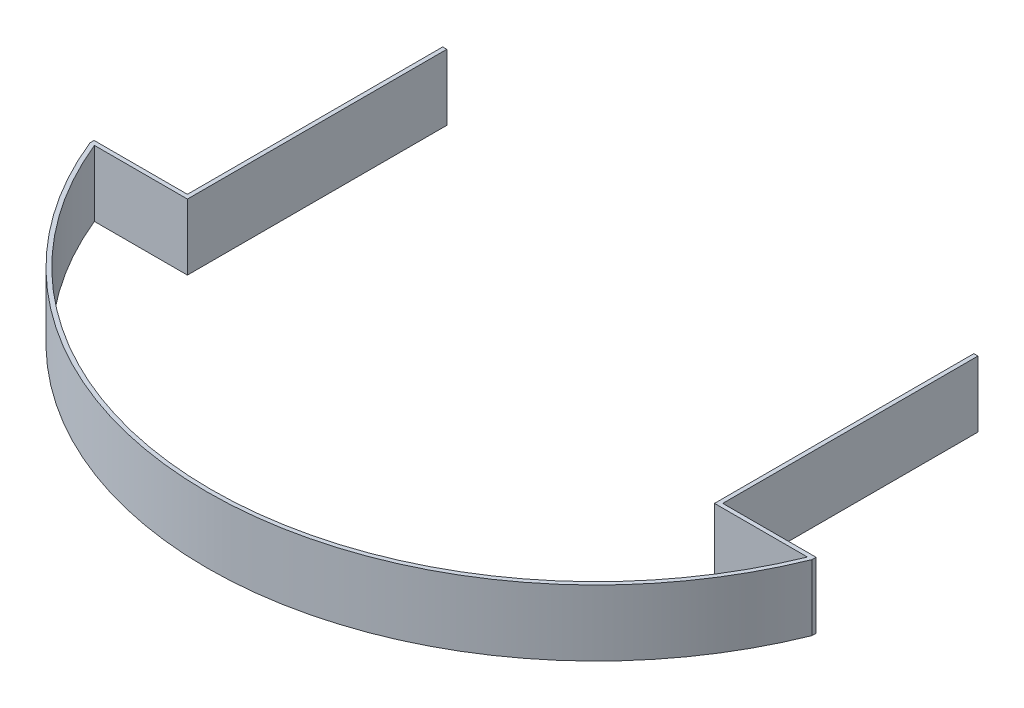
ISO-10303-21;
HEADER;
FILE_DESCRIPTION(('STEP AP214'),'2;1');
FILE_NAME('part.step','',(''),(''),'','','');
FILE_SCHEMA(('AUTOMOTIVE_DESIGN { 1 0 10303 214 1 1 1 1 }'));
ENDSEC;
DATA;
#1=APPLICATION_CONTEXT('core data for automotive mechanical design processes');
#2=APPLICATION_PROTOCOL_DEFINITION('international standard','automotive_design',2000,#1);
#3=PRODUCT_CONTEXT('',#1,'mechanical');
#4=PRODUCT('Part','Part','',(#3));
#5=PRODUCT_RELATED_PRODUCT_CATEGORY('part','',(#4));
#6=PRODUCT_DEFINITION_FORMATION('','',#4);
#7=PRODUCT_DEFINITION_CONTEXT('part definition',#1,'design');
#8=PRODUCT_DEFINITION('design','',#6,#7);
#9=PRODUCT_DEFINITION_SHAPE('','',#8);
#10=(LENGTH_UNIT() NAMED_UNIT(*) SI_UNIT(.MILLI.,.METRE.));
#11=(NAMED_UNIT(*) PLANE_ANGLE_UNIT() SI_UNIT($,.RADIAN.));
#12=(NAMED_UNIT(*) SI_UNIT($,.STERADIAN.) SOLID_ANGLE_UNIT());
#13=UNCERTAINTY_MEASURE_WITH_UNIT(LENGTH_MEASURE(1.E-05),#10,'distance_accuracy_value','');
#14=(GEOMETRIC_REPRESENTATION_CONTEXT(3) GLOBAL_UNCERTAINTY_ASSIGNED_CONTEXT((#13)) GLOBAL_UNIT_ASSIGNED_CONTEXT((#10,
#11,#12)) REPRESENTATION_CONTEXT('',''));
#15=CARTESIAN_POINT('',(0.,0.,0.));
#16=DIRECTION('',(0.,0.,1.));
#17=DIRECTION('',(1.,0.,0.));
#18=AXIS2_PLACEMENT_3D('',#15,#16,#17);
#19=CARTESIAN_POINT('',(-330.141421356237,25.4,56.));
#20=DIRECTION('',(0.,0.,-1.));
#21=DIRECTION('',(-1.,0.,0.));
#22=AXIS2_PLACEMENT_3D('',#19,#20,#21);
#23=PLANE('',#22);
#24=DIRECTION('',(1.,0.,0.));
#25=VECTOR('',#24,1.);
#26=CARTESIAN_POINT('',(-330.141421356237,0.,56.));
#27=LINE('',#26,#25);
#28=CARTESIAN_POINT('',(101.6,0.,56.));
#29=VERTEX_POINT('',#28);
#30=CARTESIAN_POINT('',(137.441339283347,0.,56.));
#31=VERTEX_POINT('',#30);
#32=EDGE_CURVE('E161',#29,#31,#27,.T.);
#33=ORIENTED_EDGE('',*,*,#32,.T.);
#34=DIRECTION('',(0.,-1.,0.));
#35=VECTOR('',#34,1.);
#36=CARTESIAN_POINT('',(137.441339283347,25.4,56.));
#37=LINE('',#36,#35);
#38=CARTESIAN_POINT('',(137.441339283347,25.4,56.));
#39=VERTEX_POINT('',#38);
#40=EDGE_CURVE('E11',#39,#31,#37,.T.);
#41=ORIENTED_EDGE('',*,*,#40,.F.);
#42=DIRECTION('',(1.,0.,0.));
#43=VECTOR('',#42,1.);
#44=CARTESIAN_POINT('',(-330.141421356237,25.4,56.));
#45=LINE('',#44,#43);
#46=CARTESIAN_POINT('',(101.6,25.4,56.));
#47=VERTEX_POINT('',#46);
#48=EDGE_CURVE('E101',#47,#39,#45,.T.);
#49=ORIENTED_EDGE('',*,*,#48,.F.);
#50=DIRECTION('',(0.,-1.,0.));
#51=VECTOR('',#50,1.);
#52=CARTESIAN_POINT('',(101.6,25.4,56.));
#53=LINE('',#52,#51);
#54=EDGE_CURVE('E157',#47,#29,#53,.T.);
#55=ORIENTED_EDGE('',*,*,#54,.T.);
#56=EDGE_LOOP('',(#33,#41,#49,#55));
#57=FACE_BOUND('',#56,.T.);
#58=ADVANCED_FACE('F31',(#57),#23,.F.);
#59=CARTESIAN_POINT('',(0.,25.4,0.));
#60=DIRECTION('',(0.,-1.,0.));
#61=DIRECTION('',(0.,0.,-1.));
#62=AXIS2_PLACEMENT_3D('',#59,#60,#61);
#63=CYLINDRICAL_SURFACE('',#62,148.412);
#64=CARTESIAN_POINT('',(0.,0.,0.));
#65=DIRECTION('',(0.,1.,0.));
#66=DIRECTION('',(0.,0.,1.));
#67=AXIS2_PLACEMENT_3D('',#64,#65,#66);
#68=CIRCLE('',#67,148.412);
#69=CARTESIAN_POINT('',(-137.441339283347,0.,56.));
#70=VERTEX_POINT('',#69);
#71=EDGE_CURVE('E164',#70,#31,#68,.T.);
#72=ORIENTED_EDGE('',*,*,#71,.F.);
#73=DIRECTION('',(0.,-1.,0.));
#74=VECTOR('',#73,1.);
#75=CARTESIAN_POINT('',(-137.441339283347,25.4,56.));
#76=LINE('',#75,#74);
#77=CARTESIAN_POINT('',(-137.441339283347,25.4,56.));
#78=VERTEX_POINT('',#77);
#79=EDGE_CURVE('E39',#78,#70,#76,.T.);
#80=ORIENTED_EDGE('',*,*,#79,.F.);
#81=CARTESIAN_POINT('',(0.,25.4,0.));
#82=DIRECTION('',(0.,1.,0.));
#83=DIRECTION('',(0.,0.,1.));
#84=AXIS2_PLACEMENT_3D('',#81,#82,#83);
#85=CIRCLE('',#84,148.412);
#86=EDGE_CURVE('E236',#78,#39,#85,.T.);
#87=ORIENTED_EDGE('',*,*,#86,.T.);
#88=ORIENTED_EDGE('',*,*,#40,.T.);
#89=EDGE_LOOP('',(#72,#80,#87,#88));
#90=FACE_BOUND('',#89,.T.);
#91=ADVANCED_FACE('F224',(#90),#63,.F.);
#92=CARTESIAN_POINT('',(-330.141421356237,25.4,56.));
#93=DIRECTION('',(0.,0.,1.));
#94=DIRECTION('',(1.,0.,0.));
#95=AXIS2_PLACEMENT_3D('',#92,#93,#94);
#96=PLANE('',#95);
#97=DIRECTION('',(-1.,0.,0.));
#98=VECTOR('',#97,1.);
#99=CARTESIAN_POINT('',(-330.141421356237,0.,56.));
#100=LINE('',#99,#98);
#101=CARTESIAN_POINT('',(-101.6,0.,56.));
#102=VERTEX_POINT('',#101);
#103=EDGE_CURVE('E167',#102,#70,#100,.T.);
#104=ORIENTED_EDGE('',*,*,#103,.F.);
#105=DIRECTION('',(0.,-1.,0.));
#106=VECTOR('',#105,1.);
#107=CARTESIAN_POINT('',(-101.6,25.4,56.));
#108=LINE('',#107,#106);
#109=CARTESIAN_POINT('',(-101.6,25.4,56.));
#110=VERTEX_POINT('',#109);
#111=EDGE_CURVE('E214',#110,#102,#108,.T.);
#112=ORIENTED_EDGE('',*,*,#111,.F.);
#113=DIRECTION('',(-1.,0.,0.));
#114=VECTOR('',#113,1.);
#115=CARTESIAN_POINT('',(-330.141421356237,25.4,56.));
#116=LINE('',#115,#114);
#117=EDGE_CURVE('E221',#110,#78,#116,.T.);
#118=ORIENTED_EDGE('',*,*,#117,.T.);
#119=ORIENTED_EDGE('',*,*,#79,.T.);
#120=EDGE_LOOP('',(#104,#112,#118,#119));
#121=FACE_BOUND('',#120,.T.);
#122=ADVANCED_FACE('F219',(#121),#96,.T.);
#123=CARTESIAN_POINT('',(-101.6,25.4,0.));
#124=DIRECTION('',(1.,0.,0.));
#125=DIRECTION('',(0.,0.,-1.));
#126=AXIS2_PLACEMENT_3D('',#123,#124,#125);
#127=PLANE('',#126);
#128=DIRECTION('',(0.,0.,1.));
#129=VECTOR('',#128,1.);
#130=CARTESIAN_POINT('',(-101.6,0.,0.));
#131=LINE('',#130,#129);
#132=CARTESIAN_POINT('',(-101.6,0.,-44.));
#133=VERTEX_POINT('',#132);
#134=EDGE_CURVE('E170',#133,#102,#131,.T.);
#135=ORIENTED_EDGE('',*,*,#134,.F.);
#136=DIRECTION('',(0.,-1.,0.));
#137=VECTOR('',#136,1.);
#138=CARTESIAN_POINT('',(-101.6,25.4,-44.));
#139=LINE('',#138,#137);
#140=CARTESIAN_POINT('',(-101.6,25.4,-44.));
#141=VERTEX_POINT('',#140);
#142=EDGE_CURVE('E212',#141,#133,#139,.T.);
#143=ORIENTED_EDGE('',*,*,#142,.F.);
#144=DIRECTION('',(0.,0.,1.));
#145=VECTOR('',#144,1.);
#146=CARTESIAN_POINT('',(-101.6,25.4,0.));
#147=LINE('',#146,#145);
#148=EDGE_CURVE('E235',#141,#110,#147,.T.);
#149=ORIENTED_EDGE('',*,*,#148,.T.);
#150=ORIENTED_EDGE('',*,*,#111,.T.);
#151=EDGE_LOOP('',(#135,#143,#149,#150));
#152=FACE_BOUND('',#151,.T.);
#153=ADVANCED_FACE('F231',(#152),#127,.T.);
#154=CARTESIAN_POINT('',(-330.141421356237,25.4,-44.));
#155=DIRECTION('',(0.,0.,1.));
#156=DIRECTION('',(1.,0.,0.));
#157=AXIS2_PLACEMENT_3D('',#154,#155,#156);
#158=PLANE('',#157);
#159=DIRECTION('',(-1.,0.,0.));
#160=VECTOR('',#159,1.);
#161=CARTESIAN_POINT('',(-330.141421356237,0.,-44.));
#162=LINE('',#161,#160);
#163=CARTESIAN_POINT('',(-103.188,0.,-44.));
#164=VERTEX_POINT('',#163);
#165=EDGE_CURVE('E173',#133,#164,#162,.T.);
#166=ORIENTED_EDGE('',*,*,#165,.T.);
#167=DIRECTION('',(0.,-1.,0.));
#168=VECTOR('',#167,1.);
#169=CARTESIAN_POINT('',(-103.188,25.4,-44.));
#170=LINE('',#169,#168);
#171=CARTESIAN_POINT('',(-103.188,25.4,-44.));
#172=VERTEX_POINT('',#171);
#173=EDGE_CURVE('E210',#172,#164,#170,.T.);
#174=ORIENTED_EDGE('',*,*,#173,.F.);
#175=DIRECTION('',(-1.,0.,0.));
#176=VECTOR('',#175,1.);
#177=CARTESIAN_POINT('',(-330.141421356237,25.4,-44.));
#178=LINE('',#177,#176);
#179=EDGE_CURVE('E238',#141,#172,#178,.T.);
#180=ORIENTED_EDGE('',*,*,#179,.F.);
#181=ORIENTED_EDGE('',*,*,#142,.T.);
#182=EDGE_LOOP('',(#166,#174,#180,#181));
#183=FACE_BOUND('',#182,.T.);
#184=ADVANCED_FACE('F289',(#183),#158,.F.);
#185=CARTESIAN_POINT('',(-103.188,25.4,0.));
#186=DIRECTION('',(-1.,0.,0.));
#187=DIRECTION('',(0.,0.,1.));
#188=AXIS2_PLACEMENT_3D('',#185,#186,#187);
#189=PLANE('',#188);
#190=DIRECTION('',(0.,0.,-1.));
#191=VECTOR('',#190,1.);
#192=CARTESIAN_POINT('',(-103.188,0.,0.));
#193=LINE('',#192,#191);
#194=CARTESIAN_POINT('',(-103.188,0.,54.4125));
#195=VERTEX_POINT('',#194);
#196=EDGE_CURVE('E176',#195,#164,#193,.T.);
#197=ORIENTED_EDGE('',*,*,#196,.F.);
#198=DIRECTION('',(0.,-1.,0.));
#199=VECTOR('',#198,1.);
#200=CARTESIAN_POINT('',(-103.188,25.4,54.4125));
#201=LINE('',#200,#199);
#202=CARTESIAN_POINT('',(-103.188,25.4,54.4125));
#203=VERTEX_POINT('',#202);
#204=EDGE_CURVE('E208',#203,#195,#201,.T.);
#205=ORIENTED_EDGE('',*,*,#204,.F.);
#206=DIRECTION('',(0.,0.,-1.));
#207=VECTOR('',#206,1.);
#208=CARTESIAN_POINT('',(-103.188,25.4,0.));
#209=LINE('',#208,#207);
#210=EDGE_CURVE('E244',#203,#172,#209,.T.);
#211=ORIENTED_EDGE('',*,*,#210,.T.);
#212=ORIENTED_EDGE('',*,*,#173,.T.);
#213=EDGE_LOOP('',(#197,#205,#211,#212));
#214=FACE_BOUND('',#213,.T.);
#215=ADVANCED_FACE('F292',(#214),#189,.T.);
#216=CARTESIAN_POINT('',(-330.141421356237,25.4,54.4125));
#217=DIRECTION('',(0.,0.,-1.));
#218=DIRECTION('',(-1.,0.,0.));
#219=AXIS2_PLACEMENT_3D('',#216,#217,#218);
#220=PLANE('',#219);
#221=DIRECTION('',(1.,0.,0.));
#222=VECTOR('',#221,1.);
#223=CARTESIAN_POINT('',(-330.141421356237,0.,54.4125));
#224=LINE('',#223,#222);
#225=CARTESIAN_POINT('',(-139.154590294392,0.,54.4125));
#226=VERTEX_POINT('',#225);
#227=EDGE_CURVE('E179',#226,#195,#224,.T.);
#228=ORIENTED_EDGE('',*,*,#227,.F.);
#229=DIRECTION('',(0.,-1.,0.));
#230=VECTOR('',#229,1.);
#231=CARTESIAN_POINT('',(-139.154590294392,25.4,54.4125));
#232=LINE('',#231,#230);
#233=CARTESIAN_POINT('',(-139.154590294392,25.4,54.4125));
#234=VERTEX_POINT('',#233);
#235=EDGE_CURVE('E206',#234,#226,#232,.T.);
#236=ORIENTED_EDGE('',*,*,#235,.F.);
#237=DIRECTION('',(1.,0.,0.));
#238=VECTOR('',#237,1.);
#239=CARTESIAN_POINT('',(-330.141421356237,25.4,54.4125));
#240=LINE('',#239,#238);
#241=EDGE_CURVE('E247',#234,#203,#240,.T.);
#242=ORIENTED_EDGE('',*,*,#241,.T.);
#243=ORIENTED_EDGE('',*,*,#204,.T.);
#244=EDGE_LOOP('',(#228,#236,#242,#243));
#245=FACE_BOUND('',#244,.T.);
#246=ADVANCED_FACE('F296',(#245),#220,.T.);
#247=CARTESIAN_POINT('',(-139.154590294392,25.4,0.));
#248=DIRECTION('',(-1.,0.,0.));
#249=DIRECTION('',(0.,0.,1.));
#250=AXIS2_PLACEMENT_3D('',#247,#248,#249);
#251=PLANE('',#250);
#252=DIRECTION('',(0.,0.,-1.));
#253=VECTOR('',#252,1.);
#254=CARTESIAN_POINT('',(-139.154590294392,0.,0.));
#255=LINE('',#254,#253);
#256=CARTESIAN_POINT('',(-139.154590294392,0.,56.));
#257=VERTEX_POINT('',#256);
#258=EDGE_CURVE('E182',#257,#226,#255,.T.);
#259=ORIENTED_EDGE('',*,*,#258,.F.);
#260=DIRECTION('',(0.,-1.,0.));
#261=VECTOR('',#260,1.);
#262=CARTESIAN_POINT('',(-139.154590294392,25.4,56.));
#263=LINE('',#262,#261);
#264=CARTESIAN_POINT('',(-139.154590294392,25.4,56.));
#265=VERTEX_POINT('',#264);
#266=EDGE_CURVE('E204',#265,#257,#263,.T.);
#267=ORIENTED_EDGE('',*,*,#266,.F.);
#268=DIRECTION('',(0.,0.,-1.));
#269=VECTOR('',#268,1.);
#270=CARTESIAN_POINT('',(-139.154590294392,25.4,0.));
#271=LINE('',#270,#269);
#272=EDGE_CURVE('E250',#265,#234,#271,.T.);
#273=ORIENTED_EDGE('',*,*,#272,.T.);
#274=ORIENTED_EDGE('',*,*,#235,.T.);
#275=EDGE_LOOP('',(#259,#267,#273,#274));
#276=FACE_BOUND('',#275,.T.);
#277=ADVANCED_FACE('F300',(#276),#251,.T.);
#278=CARTESIAN_POINT('',(0.,25.4,0.));
#279=DIRECTION('',(0.,-1.,0.));
#280=DIRECTION('',(0.,0.,-1.));
#281=AXIS2_PLACEMENT_3D('',#278,#279,#280);
#282=CYLINDRICAL_SURFACE('',#281,150.);
#283=CARTESIAN_POINT('',(0.,0.,0.));
#284=DIRECTION('',(0.,1.,0.));
#285=DIRECTION('',(0.,0.,1.));
#286=AXIS2_PLACEMENT_3D('',#283,#284,#285);
#287=CIRCLE('',#286,150.);
#288=CARTESIAN_POINT('',(139.154590294392,0.,56.));
#289=VERTEX_POINT('',#288);
#290=EDGE_CURVE('E185',#257,#289,#287,.T.);
#291=ORIENTED_EDGE('',*,*,#290,.T.);
#292=DIRECTION('',(0.,-1.,0.));
#293=VECTOR('',#292,1.);
#294=CARTESIAN_POINT('',(139.154590294392,25.4,56.));
#295=LINE('',#294,#293);
#296=CARTESIAN_POINT('',(139.154590294392,25.4,56.));
#297=VERTEX_POINT('',#296);
#298=EDGE_CURVE('E201',#297,#289,#295,.T.);
#299=ORIENTED_EDGE('',*,*,#298,.F.);
#300=CARTESIAN_POINT('',(0.,25.4,0.));
#301=DIRECTION('',(0.,1.,0.));
#302=DIRECTION('',(0.,0.,1.));
#303=AXIS2_PLACEMENT_3D('',#300,#301,#302);
#304=CIRCLE('',#303,150.);
#305=EDGE_CURVE('E253',#265,#297,#304,.T.);
#306=ORIENTED_EDGE('',*,*,#305,.F.);
#307=ORIENTED_EDGE('',*,*,#266,.T.);
#308=EDGE_LOOP('',(#291,#299,#306,#307));
#309=FACE_BOUND('',#308,.T.);
#310=ADVANCED_FACE('F304',(#309),#282,.T.);
#311=CARTESIAN_POINT('',(139.154590294392,25.4,0.));
#312=DIRECTION('',(-1.,0.,0.));
#313=DIRECTION('',(0.,0.,1.));
#314=AXIS2_PLACEMENT_3D('',#311,#312,#313);
#315=PLANE('',#314);
#316=DIRECTION('',(0.,0.,-1.));
#317=VECTOR('',#316,1.);
#318=CARTESIAN_POINT('',(139.154590294392,0.,0.));
#319=LINE('',#318,#317);
#320=CARTESIAN_POINT('',(139.154590294392,0.,54.412));
#321=VERTEX_POINT('',#320);
#322=EDGE_CURVE('E187',#289,#321,#319,.T.);
#323=ORIENTED_EDGE('',*,*,#322,.T.);
#324=DIRECTION('',(0.,-1.,0.));
#325=VECTOR('',#324,1.);
#326=CARTESIAN_POINT('',(139.154590294392,25.4,54.412));
#327=LINE('',#326,#325);
#328=CARTESIAN_POINT('',(139.154590294392,25.4,54.412));
#329=VERTEX_POINT('',#328);
#330=EDGE_CURVE('E198',#329,#321,#327,.T.);
#331=ORIENTED_EDGE('',*,*,#330,.F.);
#332=DIRECTION('',(0.,0.,-1.));
#333=VECTOR('',#332,1.);
#334=CARTESIAN_POINT('',(139.154590294392,25.4,0.));
#335=LINE('',#334,#333);
#336=EDGE_CURVE('E255',#297,#329,#335,.T.);
#337=ORIENTED_EDGE('',*,*,#336,.F.);
#338=ORIENTED_EDGE('',*,*,#298,.T.);
#339=EDGE_LOOP('',(#323,#331,#337,#338));
#340=FACE_BOUND('',#339,.T.);
#341=ADVANCED_FACE('F262',(#340),#315,.F.);
#342=CARTESIAN_POINT('',(-330.141421356237,25.4,54.4120000000001));
#343=DIRECTION('',(0.,0.,1.));
#344=DIRECTION('',(1.,0.,0.));
#345=AXIS2_PLACEMENT_3D('',#342,#343,#344);
#346=PLANE('',#345);
#347=DIRECTION('',(-1.,0.,0.));
#348=VECTOR('',#347,1.);
#349=CARTESIAN_POINT('',(-330.141421356237,0.,54.4120000000001));
#350=LINE('',#349,#348);
#351=CARTESIAN_POINT('',(103.188,0.,54.412));
#352=VERTEX_POINT('',#351);
#353=EDGE_CURVE('E189',#321,#352,#350,.T.);
#354=ORIENTED_EDGE('',*,*,#353,.T.);
#355=DIRECTION('',(0.,-1.,0.));
#356=VECTOR('',#355,1.);
#357=CARTESIAN_POINT('',(103.188,25.4,54.412));
#358=LINE('',#357,#356);
#359=CARTESIAN_POINT('',(103.188,25.4,54.412));
#360=VERTEX_POINT('',#359);
#361=EDGE_CURVE('E153',#360,#352,#358,.T.);
#362=ORIENTED_EDGE('',*,*,#361,.F.);
#363=DIRECTION('',(-1.,0.,0.));
#364=VECTOR('',#363,1.);
#365=CARTESIAN_POINT('',(-330.141421356237,25.4,54.4120000000001));
#366=LINE('',#365,#364);
#367=EDGE_CURVE('E140',#329,#360,#366,.T.);
#368=ORIENTED_EDGE('',*,*,#367,.F.);
#369=ORIENTED_EDGE('',*,*,#330,.T.);
#370=EDGE_LOOP('',(#354,#362,#368,#369));
#371=FACE_BOUND('',#370,.T.);
#372=ADVANCED_FACE('F266',(#371),#346,.F.);
#373=CARTESIAN_POINT('',(103.188,25.4,0.));
#374=DIRECTION('',(-1.,0.,0.));
#375=DIRECTION('',(0.,0.,1.));
#376=AXIS2_PLACEMENT_3D('',#373,#374,#375);
#377=PLANE('',#376);
#378=DIRECTION('',(0.,0.,-1.));
#379=VECTOR('',#378,1.);
#380=CARTESIAN_POINT('',(103.188,0.,0.));
#381=LINE('',#380,#379);
#382=CARTESIAN_POINT('',(103.188,0.,-44.));
#383=VERTEX_POINT('',#382);
#384=EDGE_CURVE('E149',#352,#383,#381,.T.);
#385=ORIENTED_EDGE('',*,*,#384,.T.);
#386=DIRECTION('',(0.,-1.,0.));
#387=VECTOR('',#386,1.);
#388=CARTESIAN_POINT('',(103.188,25.4,-44.));
#389=LINE('',#388,#387);
#390=CARTESIAN_POINT('',(103.188,25.4,-44.));
#391=VERTEX_POINT('',#390);
#392=EDGE_CURVE('E146',#391,#383,#389,.T.);
#393=ORIENTED_EDGE('',*,*,#392,.F.);
#394=DIRECTION('',(0.,0.,-1.));
#395=VECTOR('',#394,1.);
#396=CARTESIAN_POINT('',(103.188,25.4,0.));
#397=LINE('',#396,#395);
#398=EDGE_CURVE('E134',#360,#391,#397,.T.);
#399=ORIENTED_EDGE('',*,*,#398,.F.);
#400=ORIENTED_EDGE('',*,*,#361,.T.);
#401=EDGE_LOOP('',(#385,#393,#399,#400));
#402=FACE_BOUND('',#401,.T.);
#403=ADVANCED_FACE('F147',(#402),#377,.F.);
#404=CARTESIAN_POINT('',(-330.141421356237,25.4,-44.));
#405=DIRECTION('',(0.,0.,-1.));
#406=DIRECTION('',(-1.,0.,0.));
#407=AXIS2_PLACEMENT_3D('',#404,#405,#406);
#408=PLANE('',#407);
#409=DIRECTION('',(1.,0.,0.));
#410=VECTOR('',#409,1.);
#411=CARTESIAN_POINT('',(-330.141421356237,0.,-44.));
#412=LINE('',#411,#410);
#413=CARTESIAN_POINT('',(101.6,0.,-44.));
#414=VERTEX_POINT('',#413);
#415=EDGE_CURVE('E192',#414,#383,#412,.T.);
#416=ORIENTED_EDGE('',*,*,#415,.F.);
#417=DIRECTION('',(0.,-1.,0.));
#418=VECTOR('',#417,1.);
#419=CARTESIAN_POINT('',(101.6,25.4,-44.));
#420=LINE('',#419,#418);
#421=CARTESIAN_POINT('',(101.6,25.4,-44.));
#422=VERTEX_POINT('',#421);
#423=EDGE_CURVE('E92',#422,#414,#420,.T.);
#424=ORIENTED_EDGE('',*,*,#423,.F.);
#425=DIRECTION('',(1.,0.,0.));
#426=VECTOR('',#425,1.);
#427=CARTESIAN_POINT('',(-330.141421356237,25.4,-44.));
#428=LINE('',#427,#426);
#429=EDGE_CURVE('E138',#422,#391,#428,.T.);
#430=ORIENTED_EDGE('',*,*,#429,.T.);
#431=ORIENTED_EDGE('',*,*,#392,.T.);
#432=EDGE_LOOP('',(#416,#424,#430,#431));
#433=FACE_BOUND('',#432,.T.);
#434=ADVANCED_FACE('F155',(#433),#408,.T.);
#435=CARTESIAN_POINT('',(101.6,25.4,0.));
#436=DIRECTION('',(1.,0.,0.));
#437=DIRECTION('',(0.,0.,-1.));
#438=AXIS2_PLACEMENT_3D('',#435,#436,#437);
#439=PLANE('',#438);
#440=DIRECTION('',(0.,0.,1.));
#441=VECTOR('',#440,1.);
#442=CARTESIAN_POINT('',(101.6,0.,0.));
#443=LINE('',#442,#441);
#444=EDGE_CURVE('E95',#414,#29,#443,.T.);
#445=ORIENTED_EDGE('',*,*,#444,.T.);
#446=ORIENTED_EDGE('',*,*,#54,.F.);
#447=DIRECTION('',(0.,0.,1.));
#448=VECTOR('',#447,1.);
#449=CARTESIAN_POINT('',(101.6,25.4,0.));
#450=LINE('',#449,#448);
#451=EDGE_CURVE('E47',#422,#47,#450,.T.);
#452=ORIENTED_EDGE('',*,*,#451,.F.);
#453=ORIENTED_EDGE('',*,*,#423,.T.);
#454=EDGE_LOOP('',(#445,#446,#452,#453));
#455=FACE_BOUND('',#454,.T.);
#456=ADVANCED_FACE('F268',(#455),#439,.F.);
#457=CARTESIAN_POINT('',(-330.141421356237,25.4,0.));
#458=DIRECTION('',(0.,1.,0.));
#459=DIRECTION('',(0.,0.,1.));
#460=AXIS2_PLACEMENT_3D('',#457,#458,#459);
#461=PLANE('',#460);
#462=ORIENTED_EDGE('',*,*,#48,.T.);
#463=ORIENTED_EDGE('',*,*,#86,.F.);
#464=ORIENTED_EDGE('',*,*,#117,.F.);
#465=ORIENTED_EDGE('',*,*,#148,.F.);
#466=ORIENTED_EDGE('',*,*,#179,.T.);
#467=ORIENTED_EDGE('',*,*,#210,.F.);
#468=ORIENTED_EDGE('',*,*,#241,.F.);
#469=ORIENTED_EDGE('',*,*,#272,.F.);
#470=ORIENTED_EDGE('',*,*,#305,.T.);
#471=ORIENTED_EDGE('',*,*,#336,.T.);
#472=ORIENTED_EDGE('',*,*,#367,.T.);
#473=ORIENTED_EDGE('',*,*,#398,.T.);
#474=ORIENTED_EDGE('',*,*,#429,.F.);
#475=ORIENTED_EDGE('',*,*,#451,.T.);
#476=EDGE_LOOP('',(#462,#463,#464,#465,#466,#467,#468,#469,#470,#471,#472,#473,#474,#475));
#477=FACE_BOUND('',#476,.T.);
#478=ADVANCED_FACE('F136',(#477),#461,.T.);
#479=CARTESIAN_POINT('',(-330.141421356237,0.,0.));
#480=DIRECTION('',(0.,1.,0.));
#481=DIRECTION('',(0.,0.,1.));
#482=AXIS2_PLACEMENT_3D('',#479,#480,#481);
#483=PLANE('',#482);
#484=ORIENTED_EDGE('',*,*,#32,.F.);
#485=ORIENTED_EDGE('',*,*,#444,.F.);
#486=ORIENTED_EDGE('',*,*,#415,.T.);
#487=ORIENTED_EDGE('',*,*,#384,.F.);
#488=ORIENTED_EDGE('',*,*,#353,.F.);
#489=ORIENTED_EDGE('',*,*,#322,.F.);
#490=ORIENTED_EDGE('',*,*,#290,.F.);
#491=ORIENTED_EDGE('',*,*,#258,.T.);
#492=ORIENTED_EDGE('',*,*,#227,.T.);
#493=ORIENTED_EDGE('',*,*,#196,.T.);
#494=ORIENTED_EDGE('',*,*,#165,.F.);
#495=ORIENTED_EDGE('',*,*,#134,.T.);
#496=ORIENTED_EDGE('',*,*,#103,.T.);
#497=ORIENTED_EDGE('',*,*,#71,.T.);
#498=EDGE_LOOP('',(#484,#485,#486,#487,#488,#489,#490,#491,#492,#493,#494,#495,#496,#497));
#499=FACE_BOUND('',#498,.T.);
#500=ADVANCED_FACE('F227',(#499),#483,.F.);
#501=CLOSED_SHELL('',(#58,#91,#122,#153,#184,#215,#246,#277,#310,#341,#372,#403,#434,#456,#478,#500));
#502=MANIFOLD_SOLID_BREP('B2',#501);
#503=ADVANCED_BREP_SHAPE_REPRESENTATION('',(#18,#502),#14);
#504=SHAPE_DEFINITION_REPRESENTATION(#9,#503);
ENDSEC;
END-ISO-10303-21;
